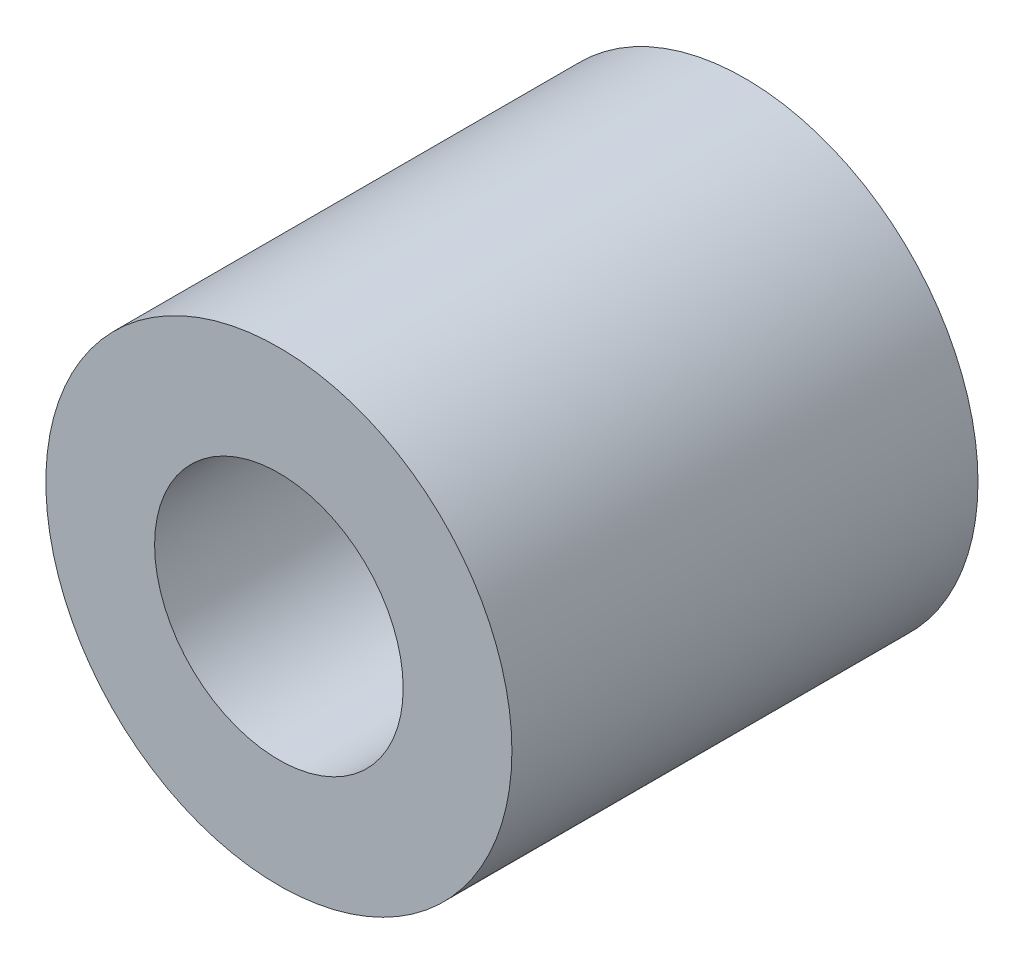
ISO-10303-21;
HEADER;
FILE_DESCRIPTION(('STEP AP214'),'2;1');
FILE_NAME('part.step','',(''),(''),'','','');
FILE_SCHEMA(('AUTOMOTIVE_DESIGN { 1 0 10303 214 1 1 1 1 }'));
ENDSEC;
DATA;
#1=APPLICATION_CONTEXT('core data for automotive mechanical design processes');
#2=APPLICATION_PROTOCOL_DEFINITION('international standard','automotive_design',2000,#1);
#3=PRODUCT_CONTEXT('',#1,'mechanical');
#4=PRODUCT('Part','Part','',(#3));
#5=PRODUCT_RELATED_PRODUCT_CATEGORY('part','',(#4));
#6=PRODUCT_DEFINITION_FORMATION('','',#4);
#7=PRODUCT_DEFINITION_CONTEXT('part definition',#1,'design');
#8=PRODUCT_DEFINITION('design','',#6,#7);
#9=PRODUCT_DEFINITION_SHAPE('','',#8);
#10=(LENGTH_UNIT() NAMED_UNIT(*) SI_UNIT(.MILLI.,.METRE.));
#11=(NAMED_UNIT(*) PLANE_ANGLE_UNIT() SI_UNIT($,.RADIAN.));
#12=(NAMED_UNIT(*) SI_UNIT($,.STERADIAN.) SOLID_ANGLE_UNIT());
#13=UNCERTAINTY_MEASURE_WITH_UNIT(LENGTH_MEASURE(1.E-05),#10,'distance_accuracy_value','');
#14=(GEOMETRIC_REPRESENTATION_CONTEXT(3) GLOBAL_UNCERTAINTY_ASSIGNED_CONTEXT((#13)) GLOBAL_UNIT_ASSIGNED_CONTEXT((#10,
#11,#12)) REPRESENTATION_CONTEXT('',''));
#15=CARTESIAN_POINT('',(0.,0.,0.));
#16=DIRECTION('',(0.,0.,1.));
#17=DIRECTION('',(1.,0.,0.));
#18=AXIS2_PLACEMENT_3D('',#15,#16,#17);
#19=CARTESIAN_POINT('',(0.,0.,6.));
#20=DIRECTION('',(0.,0.,1.));
#21=DIRECTION('',(1.,0.,0.));
#22=AXIS2_PLACEMENT_3D('',#19,#20,#21);
#23=PLANE('',#22);
#24=CARTESIAN_POINT('',(0.,0.,6.));
#25=DIRECTION('',(0.,0.,1.));
#26=DIRECTION('',(1.,0.,0.));
#27=AXIS2_PLACEMENT_3D('',#24,#25,#26);
#28=CIRCLE('',#27,3.);
#29=CARTESIAN_POINT('',(3.,0.,6.));
#30=VERTEX_POINT('',#29);
#31=EDGE_CURVE('E10',#30,#30,#28,.T.);
#32=ORIENTED_EDGE('',*,*,#31,.T.);
#33=EDGE_LOOP('',(#32));
#34=FACE_BOUND('',#33,.T.);
#35=CARTESIAN_POINT('',(0.,0.,6.));
#36=DIRECTION('',(0.,0.,1.));
#37=DIRECTION('',(1.,0.,0.));
#38=AXIS2_PLACEMENT_3D('',#35,#36,#37);
#39=CIRCLE('',#38,1.6);
#40=CARTESIAN_POINT('',(1.6,0.,6.));
#41=VERTEX_POINT('',#40);
#42=EDGE_CURVE('E35',#41,#41,#39,.T.);
#43=ORIENTED_EDGE('',*,*,#42,.F.);
#44=EDGE_LOOP('',(#43));
#45=FACE_BOUND('',#44,.T.);
#46=ADVANCED_FACE('F24',(#34,#45),#23,.T.);
#47=CARTESIAN_POINT('',(0.,0.,0.));
#48=DIRECTION('',(0.,0.,1.));
#49=DIRECTION('',(1.,0.,0.));
#50=AXIS2_PLACEMENT_3D('',#47,#48,#49);
#51=PLANE('',#50);
#52=CARTESIAN_POINT('',(0.,0.,0.));
#53=DIRECTION('',(0.,0.,1.));
#54=DIRECTION('',(1.,0.,0.));
#55=AXIS2_PLACEMENT_3D('',#52,#53,#54);
#56=CIRCLE('',#55,3.);
#57=CARTESIAN_POINT('',(3.,0.,0.));
#58=VERTEX_POINT('',#57);
#59=EDGE_CURVE('E31',#58,#58,#56,.T.);
#60=ORIENTED_EDGE('',*,*,#59,.F.);
#61=EDGE_LOOP('',(#60));
#62=FACE_BOUND('',#61,.T.);
#63=CARTESIAN_POINT('',(0.,0.,0.));
#64=DIRECTION('',(0.,0.,1.));
#65=DIRECTION('',(1.,0.,0.));
#66=AXIS2_PLACEMENT_3D('',#63,#64,#65);
#67=CIRCLE('',#66,1.6);
#68=CARTESIAN_POINT('',(1.6,0.,0.));
#69=VERTEX_POINT('',#68);
#70=EDGE_CURVE('E39',#69,#69,#67,.T.);
#71=ORIENTED_EDGE('',*,*,#70,.T.);
#72=EDGE_LOOP('',(#71));
#73=FACE_BOUND('',#72,.T.);
#74=ADVANCED_FACE('F45',(#62,#73),#51,.F.);
#75=CARTESIAN_POINT('',(0.,0.,6.));
#76=DIRECTION('',(0.,0.,-1.));
#77=DIRECTION('',(-1.,0.,0.));
#78=AXIS2_PLACEMENT_3D('',#75,#76,#77);
#79=CYLINDRICAL_SURFACE('',#78,3.);
#80=ORIENTED_EDGE('',*,*,#31,.F.);
#81=EDGE_LOOP('',(#80));
#82=FACE_BOUND('',#81,.T.);
#83=ORIENTED_EDGE('',*,*,#59,.T.);
#84=EDGE_LOOP('',(#83));
#85=FACE_BOUND('',#84,.T.);
#86=ADVANCED_FACE('F26',(#82,#85),#79,.T.);
#87=CARTESIAN_POINT('',(0.,0.,6.));
#88=DIRECTION('',(0.,0.,-1.));
#89=DIRECTION('',(-1.,0.,0.));
#90=AXIS2_PLACEMENT_3D('',#87,#88,#89);
#91=CYLINDRICAL_SURFACE('',#90,1.6);
#92=ORIENTED_EDGE('',*,*,#42,.T.);
#93=EDGE_LOOP('',(#92));
#94=FACE_BOUND('',#93,.T.);
#95=ORIENTED_EDGE('',*,*,#70,.F.);
#96=EDGE_LOOP('',(#95));
#97=FACE_BOUND('',#96,.T.);
#98=ADVANCED_FACE('F47',(#94,#97),#91,.F.);
#99=CLOSED_SHELL('',(#46,#74,#86,#98));
#100=MANIFOLD_SOLID_BREP('B2',#99);
#101=ADVANCED_BREP_SHAPE_REPRESENTATION('',(#18,#100),#14);
#102=SHAPE_DEFINITION_REPRESENTATION(#9,#101);
ENDSEC;
END-ISO-10303-21;
